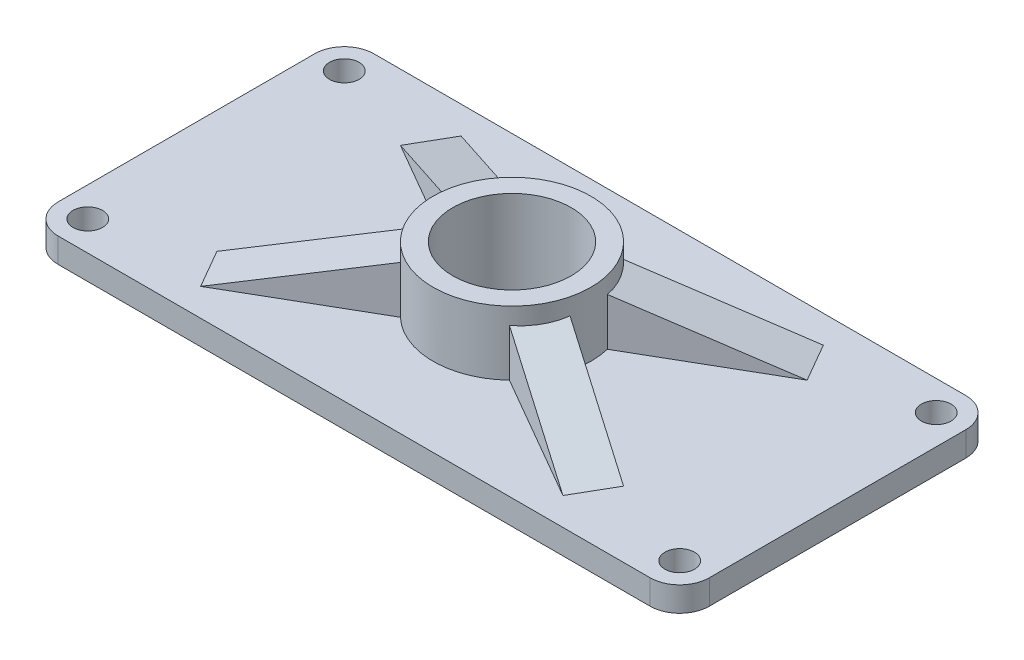
ISO-10303-21;
HEADER;
FILE_DESCRIPTION(('STEP AP214'),'2;1');
FILE_NAME('part.step','',(''),(''),'','','');
FILE_SCHEMA(('AUTOMOTIVE_DESIGN { 1 0 10303 214 1 1 1 1 }'));
ENDSEC;
DATA;
#1=APPLICATION_CONTEXT('core data for automotive mechanical design processes');
#2=APPLICATION_PROTOCOL_DEFINITION('international standard','automotive_design',2000,#1);
#3=PRODUCT_CONTEXT('',#1,'mechanical');
#4=PRODUCT('Part','Part','',(#3));
#5=PRODUCT_RELATED_PRODUCT_CATEGORY('part','',(#4));
#6=PRODUCT_DEFINITION_FORMATION('','',#4);
#7=PRODUCT_DEFINITION_CONTEXT('part definition',#1,'design');
#8=PRODUCT_DEFINITION('design','',#6,#7);
#9=PRODUCT_DEFINITION_SHAPE('','',#8);
#10=(LENGTH_UNIT() NAMED_UNIT(*) SI_UNIT(.MILLI.,.METRE.));
#11=(NAMED_UNIT(*) PLANE_ANGLE_UNIT() SI_UNIT($,.RADIAN.));
#12=(NAMED_UNIT(*) SI_UNIT($,.STERADIAN.) SOLID_ANGLE_UNIT());
#13=UNCERTAINTY_MEASURE_WITH_UNIT(LENGTH_MEASURE(1.E-05),#10,'distance_accuracy_value','');
#14=(GEOMETRIC_REPRESENTATION_CONTEXT(3) GLOBAL_UNCERTAINTY_ASSIGNED_CONTEXT((#13)) GLOBAL_UNIT_ASSIGNED_CONTEXT((#10,
#11,#12)) REPRESENTATION_CONTEXT('',''));
#15=CARTESIAN_POINT('',(0.,0.,0.));
#16=DIRECTION('',(0.,0.,1.));
#17=DIRECTION('',(1.,0.,0.));
#18=AXIS2_PLACEMENT_3D('',#15,#16,#17);
#19=CARTESIAN_POINT('',(0.,5.,0.));
#20=DIRECTION('',(0.,1.,0.));
#21=DIRECTION('',(0.,0.,1.));
#22=AXIS2_PLACEMENT_3D('',#19,#20,#21);
#23=PLANE('',#22);
#24=DIRECTION('',(0.866025403784438,0.,-0.500000000000001));
#25=VECTOR('',#24,1.);
#26=CARTESIAN_POINT('',(8.14230484541325,5.,-9.89711431702998));
#27=LINE('',#26,#25);
#28=CARTESIAN_POINT('',(11.0470861469722,5.,-11.574190583422));
#29=VERTEX_POINT('',#28);
#30=CARTESIAN_POINT('',(36.7211431702997,5.,-26.39711431703));
#31=VERTEX_POINT('',#30);
#32=EDGE_CURVE('E54',#29,#31,#27,.T.);
#33=ORIENTED_EDGE('',*,*,#32,.T.);
#34=DIRECTION('',(0.500000000000001,0.,0.866025403784438));
#35=VECTOR('',#34,1.);
#36=CARTESIAN_POINT('',(36.7211431702997,5.,-26.39711431703));
#37=LINE('',#36,#35);
#38=CARTESIAN_POINT('',(41.2211431702997,5.,-18.6028856829701));
#39=VERTEX_POINT('',#38);
#40=EDGE_CURVE('E58',#31,#39,#37,.T.);
#41=ORIENTED_EDGE('',*,*,#40,.T.);
#42=DIRECTION('',(0.866025403784438,0.,-0.500000000000001));
#43=VECTOR('',#42,1.);
#44=CARTESIAN_POINT('',(12.6423048454133,5.,-2.10288568297004));
#45=LINE('',#44,#43);
#46=CARTESIAN_POINT('',(15.5470861469722,5.,-3.77996194936209));
#47=VERTEX_POINT('',#46);
#48=EDGE_CURVE('E185',#47,#39,#45,.T.);
#49=ORIENTED_EDGE('',*,*,#48,.F.);
#50=CARTESIAN_POINT('',(0.,5.,0.));
#51=DIRECTION('',(0.,1.,0.));
#52=DIRECTION('',(0.,0.,1.));
#53=AXIS2_PLACEMENT_3D('',#50,#51,#52);
#54=CIRCLE('',#53,16.);
#55=CARTESIAN_POINT('',(15.5470861469722,5.,3.77996194936209));
#56=VERTEX_POINT('',#55);
#57=EDGE_CURVE('E174',#56,#47,#54,.T.);
#58=ORIENTED_EDGE('',*,*,#57,.F.);
#59=DIRECTION('',(0.866025403784438,0.,0.500000000000001));
#60=VECTOR('',#59,1.);
#61=CARTESIAN_POINT('',(12.6423048454133,5.,2.10288568297004));
#62=LINE('',#61,#60);
#63=CARTESIAN_POINT('',(41.2211431702997,5.,18.6028856829701));
#64=VERTEX_POINT('',#63);
#65=EDGE_CURVE('E325',#56,#64,#62,.T.);
#66=ORIENTED_EDGE('',*,*,#65,.T.);
#67=DIRECTION('',(0.500000000000001,0.,-0.866025403784438));
#68=VECTOR('',#67,1.);
#69=CARTESIAN_POINT('',(36.7211431702997,5.,26.39711431703));
#70=LINE('',#69,#68);
#71=CARTESIAN_POINT('',(36.7211431702997,5.,26.39711431703));
#72=VERTEX_POINT('',#71);
#73=EDGE_CURVE('E321',#72,#64,#70,.T.);
#74=ORIENTED_EDGE('',*,*,#73,.F.);
#75=DIRECTION('',(0.866025403784438,0.,0.500000000000001));
#76=VECTOR('',#75,1.);
#77=CARTESIAN_POINT('',(8.14230484541325,5.,9.89711431702998));
#78=LINE('',#77,#76);
#79=CARTESIAN_POINT('',(11.0470861469722,5.,11.574190583422));
#80=VERTEX_POINT('',#79);
#81=EDGE_CURVE('E324',#80,#72,#78,.T.);
#82=ORIENTED_EDGE('',*,*,#81,.F.);
#83=CARTESIAN_POINT('',(-11.0470861469722,5.,11.574190583422));
#84=VERTEX_POINT('',#83);
#85=EDGE_CURVE('E181',#84,#80,#54,.T.);
#86=ORIENTED_EDGE('',*,*,#85,.F.);
#87=DIRECTION('',(0.866025403784438,0.,-0.500000000000001));
#88=VECTOR('',#87,1.);
#89=CARTESIAN_POINT('',(-36.7211431702997,5.,26.39711431703));
#90=LINE('',#89,#88);
#91=CARTESIAN_POINT('',(-36.7211431702997,5.,26.39711431703));
#92=VERTEX_POINT('',#91);
#93=EDGE_CURVE('E345',#92,#84,#90,.T.);
#94=ORIENTED_EDGE('',*,*,#93,.F.);
#95=DIRECTION('',(0.500000000000001,0.,0.866025403784438));
#96=VECTOR('',#95,1.);
#97=CARTESIAN_POINT('',(-41.2211431702997,5.,18.6028856829701));
#98=LINE('',#97,#96);
#99=CARTESIAN_POINT('',(-41.2211431702997,5.,18.6028856829701));
#100=VERTEX_POINT('',#99);
#101=EDGE_CURVE('E338',#100,#92,#98,.T.);
#102=ORIENTED_EDGE('',*,*,#101,.F.);
#103=DIRECTION('',(0.866025403784438,0.,-0.500000000000001));
#104=VECTOR('',#103,1.);
#105=CARTESIAN_POINT('',(-41.2211431702997,5.,18.6028856829701));
#106=LINE('',#105,#104);
#107=CARTESIAN_POINT('',(-15.5470861469722,5.,3.77996194936209));
#108=VERTEX_POINT('',#107);
#109=EDGE_CURVE('E344',#100,#108,#106,.T.);
#110=ORIENTED_EDGE('',*,*,#109,.T.);
#111=CARTESIAN_POINT('',(-15.5470861469722,5.,-3.77996194936209));
#112=VERTEX_POINT('',#111);
#113=EDGE_CURVE('E184',#112,#108,#54,.T.);
#114=ORIENTED_EDGE('',*,*,#113,.F.);
#115=DIRECTION('',(0.866025403784438,0.,0.500000000000001));
#116=VECTOR('',#115,1.);
#117=CARTESIAN_POINT('',(-41.2211431702997,5.,-18.6028856829701));
#118=LINE('',#117,#116);
#119=CARTESIAN_POINT('',(-41.2211431702997,5.,-18.6028856829701));
#120=VERTEX_POINT('',#119);
#121=EDGE_CURVE('E309',#120,#112,#118,.T.);
#122=ORIENTED_EDGE('',*,*,#121,.F.);
#123=DIRECTION('',(0.500000000000001,0.,-0.866025403784438));
#124=VECTOR('',#123,1.);
#125=CARTESIAN_POINT('',(-41.2211431702997,5.,-18.6028856829701));
#126=LINE('',#125,#124);
#127=CARTESIAN_POINT('',(-36.7211431702997,5.,-26.39711431703));
#128=VERTEX_POINT('',#127);
#129=EDGE_CURVE('E306',#120,#128,#126,.T.);
#130=ORIENTED_EDGE('',*,*,#129,.T.);
#131=DIRECTION('',(0.866025403784438,0.,0.500000000000001));
#132=VECTOR('',#131,1.);
#133=CARTESIAN_POINT('',(-36.7211431702997,5.,-26.39711431703));
#134=LINE('',#133,#132);
#135=CARTESIAN_POINT('',(-11.0470861469722,5.,-11.574190583422));
#136=VERTEX_POINT('',#135);
#137=EDGE_CURVE('E310',#128,#136,#134,.T.);
#138=ORIENTED_EDGE('',*,*,#137,.T.);
#139=EDGE_CURVE('E182',#29,#136,#54,.T.);
#140=ORIENTED_EDGE('',*,*,#139,.F.);
#141=EDGE_LOOP('',(#33,#41,#49,#58,#66,#74,#82,#86,#94,#102,#110,#114,#122,#130,#138,#140));
#142=FACE_BOUND('',#141,.T.);
#143=CARTESIAN_POINT('',(60.,5.,-26.));
#144=DIRECTION('',(0.,1.,0.));
#145=DIRECTION('',(0.,0.,1.));
#146=AXIS2_PLACEMENT_3D('',#143,#144,#145);
#147=CIRCLE('',#146,3.);
#148=CARTESIAN_POINT('',(60.,5.,-23.));
#149=VERTEX_POINT('',#148);
#150=EDGE_CURVE('E229',#149,#149,#147,.T.);
#151=ORIENTED_EDGE('',*,*,#150,.F.);
#152=EDGE_LOOP('',(#151));
#153=FACE_BOUND('',#152,.T.);
#154=CARTESIAN_POINT('',(60.,5.,26.));
#155=DIRECTION('',(0.,1.,0.));
#156=DIRECTION('',(0.,0.,1.));
#157=AXIS2_PLACEMENT_3D('',#154,#155,#156);
#158=CIRCLE('',#157,3.);
#159=CARTESIAN_POINT('',(60.,5.,29.));
#160=VERTEX_POINT('',#159);
#161=EDGE_CURVE('E271',#160,#160,#158,.T.);
#162=ORIENTED_EDGE('',*,*,#161,.F.);
#163=EDGE_LOOP('',(#162));
#164=FACE_BOUND('',#163,.T.);
#165=CARTESIAN_POINT('',(-60.,5.,26.));
#166=DIRECTION('',(0.,1.,0.));
#167=DIRECTION('',(0.,0.,1.));
#168=AXIS2_PLACEMENT_3D('',#165,#166,#167);
#169=CIRCLE('',#168,3.);
#170=CARTESIAN_POINT('',(-60.,5.,29.));
#171=VERTEX_POINT('',#170);
#172=EDGE_CURVE('E274',#171,#171,#169,.T.);
#173=ORIENTED_EDGE('',*,*,#172,.F.);
#174=EDGE_LOOP('',(#173));
#175=FACE_BOUND('',#174,.T.);
#176=CARTESIAN_POINT('',(-60.,5.,-26.));
#177=DIRECTION('',(0.,1.,0.));
#178=DIRECTION('',(0.,0.,1.));
#179=AXIS2_PLACEMENT_3D('',#176,#177,#178);
#180=CIRCLE('',#179,3.);
#181=CARTESIAN_POINT('',(-60.,5.,-23.));
#182=VERTEX_POINT('',#181);
#183=EDGE_CURVE('E277',#182,#182,#180,.T.);
#184=ORIENTED_EDGE('',*,*,#183,.F.);
#185=EDGE_LOOP('',(#184));
#186=FACE_BOUND('',#185,.T.);
#187=CARTESIAN_POINT('',(-60.,5.,-26.));
#188=DIRECTION('',(0.,1.,0.));
#189=DIRECTION('',(0.,0.,1.));
#190=AXIS2_PLACEMENT_3D('',#187,#188,#189);
#191=CIRCLE('',#190,6.);
#192=CARTESIAN_POINT('',(-66.,5.,-26.));
#193=VERTEX_POINT('',#192);
#194=CARTESIAN_POINT('',(-60.,5.,-32.));
#195=VERTEX_POINT('',#194);
#196=EDGE_CURVE('E233',#193,#195,#191,.F.);
#197=ORIENTED_EDGE('',*,*,#196,.F.);
#198=DIRECTION('',(0.,0.,-1.));
#199=VECTOR('',#198,1.);
#200=CARTESIAN_POINT('',(-66.,5.,0.));
#201=LINE('',#200,#199);
#202=CARTESIAN_POINT('',(-66.,5.,26.));
#203=VERTEX_POINT('',#202);
#204=EDGE_CURVE('E295',#203,#193,#201,.T.);
#205=ORIENTED_EDGE('',*,*,#204,.F.);
#206=CARTESIAN_POINT('',(-60.,5.,26.));
#207=DIRECTION('',(0.,1.,0.));
#208=DIRECTION('',(0.,0.,1.));
#209=AXIS2_PLACEMENT_3D('',#206,#207,#208);
#210=CIRCLE('',#209,5.99999999999999);
#211=CARTESIAN_POINT('',(-60.,5.,32.));
#212=VERTEX_POINT('',#211);
#213=EDGE_CURVE('E292',#212,#203,#210,.F.);
#214=ORIENTED_EDGE('',*,*,#213,.F.);
#215=DIRECTION('',(1.,0.,0.));
#216=VECTOR('',#215,1.);
#217=CARTESIAN_POINT('',(0.,5.,32.));
#218=LINE('',#217,#216);
#219=CARTESIAN_POINT('',(60.,5.,32.));
#220=VERTEX_POINT('',#219);
#221=EDGE_CURVE('E290',#212,#220,#218,.T.);
#222=ORIENTED_EDGE('',*,*,#221,.T.);
#223=CARTESIAN_POINT('',(60.,5.,26.));
#224=DIRECTION('',(0.,1.,0.));
#225=DIRECTION('',(0.,0.,1.));
#226=AXIS2_PLACEMENT_3D('',#223,#224,#225);
#227=CIRCLE('',#226,5.99999999999999);
#228=CARTESIAN_POINT('',(66.,5.,26.));
#229=VERTEX_POINT('',#228);
#230=EDGE_CURVE('E288',#220,#229,#227,.T.);
#231=ORIENTED_EDGE('',*,*,#230,.T.);
#232=DIRECTION('',(0.,0.,-1.));
#233=VECTOR('',#232,1.);
#234=CARTESIAN_POINT('',(66.,5.,0.));
#235=LINE('',#234,#233);
#236=CARTESIAN_POINT('',(66.,5.,-26.));
#237=VERTEX_POINT('',#236);
#238=EDGE_CURVE('E286',#229,#237,#235,.T.);
#239=ORIENTED_EDGE('',*,*,#238,.T.);
#240=CARTESIAN_POINT('',(60.,5.,-26.));
#241=DIRECTION('',(0.,1.,0.));
#242=DIRECTION('',(0.,0.,1.));
#243=AXIS2_PLACEMENT_3D('',#240,#241,#242);
#244=CIRCLE('',#243,6.);
#245=CARTESIAN_POINT('',(60.,5.,-32.));
#246=VERTEX_POINT('',#245);
#247=EDGE_CURVE('E283',#246,#237,#244,.F.);
#248=ORIENTED_EDGE('',*,*,#247,.F.);
#249=DIRECTION('',(1.,0.,0.));
#250=VECTOR('',#249,1.);
#251=CARTESIAN_POINT('',(0.,5.,-32.));
#252=LINE('',#251,#250);
#253=EDGE_CURVE('E280',#195,#246,#252,.T.);
#254=ORIENTED_EDGE('',*,*,#253,.F.);
#255=EDGE_LOOP('',(#197,#205,#214,#222,#231,#239,#248,#254));
#256=FACE_BOUND('',#255,.T.);
#257=ADVANCED_FACE('F39',(#142,#153,#164,#175,#186,#256),#23,.T.);
#258=CARTESIAN_POINT('',(0.,18.,0.));
#259=DIRECTION('',(0.,-1.,0.));
#260=DIRECTION('',(0.,0.,-1.));
#261=AXIS2_PLACEMENT_3D('',#258,#259,#260);
#262=CYLINDRICAL_SURFACE('',#261,16.);
#263=CARTESIAN_POINT('',(0.,18.,0.));
#264=DIRECTION('',(0.,1.,0.));
#265=DIRECTION('',(0.,0.,1.));
#266=AXIS2_PLACEMENT_3D('',#263,#264,#265);
#267=CIRCLE('',#266,16.);
#268=CARTESIAN_POINT('',(0.,18.,16.));
#269=VERTEX_POINT('',#268);
#270=EDGE_CURVE('E268',#269,#269,#267,.T.);
#271=ORIENTED_EDGE('',*,*,#270,.F.);
#272=EDGE_LOOP('',(#271));
#273=FACE_BOUND('',#272,.T.);
#274=CARTESIAN_POINT('',(0.,19.6213863304805,0.));
#275=DIRECTION('',(0.267616567329812,0.951056516295155,-0.154508497187471));
#276=DIRECTION('',(0.823639103546333,-0.309016994374941,-0.475528258147579));
#277=AXIS2_PLACEMENT_3D('',#274,#275,#276);
#278=ELLIPSE('',#277,16.8233955878122,16.);
#279=CARTESIAN_POINT('',(15.5470861469722,14.6325197536147,-3.77996194936209));
#280=VERTEX_POINT('',#279);
#281=CARTESIAN_POINT('',(11.0470861469722,14.6325197536147,-11.574190583422));
#282=VERTEX_POINT('',#281);
#283=EDGE_CURVE('E347',#280,#282,#278,.T.);
#284=ORIENTED_EDGE('',*,*,#283,.T.);
#285=DIRECTION('',(0.,-1.,0.));
#286=VECTOR('',#285,1.);
#287=CARTESIAN_POINT('',(11.0470861469722,18.,-11.574190583422));
#288=LINE('',#287,#286);
#289=EDGE_CURVE('E11',#282,#29,#288,.T.);
#290=ORIENTED_EDGE('',*,*,#289,.T.);
#291=ORIENTED_EDGE('',*,*,#139,.T.);
#292=DIRECTION('',(0.,-1.,0.));
#293=VECTOR('',#292,1.);
#294=CARTESIAN_POINT('',(-11.0470861469722,18.,-11.574190583422));
#295=LINE('',#294,#293);
#296=CARTESIAN_POINT('',(-11.0470861469722,14.6325197536147,-11.574190583422));
#297=VERTEX_POINT('',#296);
#298=EDGE_CURVE('E208',#136,#297,#295,.F.);
#299=ORIENTED_EDGE('',*,*,#298,.T.);
#300=CARTESIAN_POINT('',(0.,19.6213863304805,0.));
#301=DIRECTION('',(0.267616567329812,-0.951056516295155,0.154508497187471));
#302=DIRECTION('',(-0.823639103546333,-0.309016994374942,-0.475528258147579));
#303=AXIS2_PLACEMENT_3D('',#300,#301,#302);
#304=ELLIPSE('',#303,16.8233955878122,16.);
#305=CARTESIAN_POINT('',(-15.5470861469722,14.6325197536147,-3.77996194936209));
#306=VERTEX_POINT('',#305);
#307=EDGE_CURVE('E205',#306,#297,#304,.T.);
#308=ORIENTED_EDGE('',*,*,#307,.F.);
#309=DIRECTION('',(0.,-1.,0.));
#310=VECTOR('',#309,1.);
#311=CARTESIAN_POINT('',(-15.5470861469722,18.,-3.77996194936209));
#312=LINE('',#311,#310);
#313=EDGE_CURVE('E203',#112,#306,#312,.F.);
#314=ORIENTED_EDGE('',*,*,#313,.F.);
#315=ORIENTED_EDGE('',*,*,#113,.T.);
#316=DIRECTION('',(0.,-1.,0.));
#317=VECTOR('',#316,1.);
#318=CARTESIAN_POINT('',(-15.5470861469722,18.,3.77996194936209));
#319=LINE('',#318,#317);
#320=CARTESIAN_POINT('',(-15.5470861469722,14.6325197536147,3.77996194936209));
#321=VERTEX_POINT('',#320);
#322=EDGE_CURVE('E194',#321,#108,#319,.T.);
#323=ORIENTED_EDGE('',*,*,#322,.F.);
#324=CARTESIAN_POINT('',(0.,19.6213863304805,0.));
#325=DIRECTION('',(-0.267616567329812,0.951056516295155,0.154508497187471));
#326=DIRECTION('',(-0.823639103546333,-0.309016994374942,0.475528258147579));
#327=AXIS2_PLACEMENT_3D('',#324,#325,#326);
#328=ELLIPSE('',#327,16.8233955878122,16.);
#329=CARTESIAN_POINT('',(-11.0470861469722,14.6325197536147,11.574190583422));
#330=VERTEX_POINT('',#329);
#331=EDGE_CURVE('E331',#321,#330,#328,.T.);
#332=ORIENTED_EDGE('',*,*,#331,.T.);
#333=DIRECTION('',(0.,-1.,0.));
#334=VECTOR('',#333,1.);
#335=CARTESIAN_POINT('',(-11.0470861469722,18.,11.574190583422));
#336=LINE('',#335,#334);
#337=EDGE_CURVE('E195',#330,#84,#336,.T.);
#338=ORIENTED_EDGE('',*,*,#337,.T.);
#339=ORIENTED_EDGE('',*,*,#85,.T.);
#340=DIRECTION('',(0.,-1.,0.));
#341=VECTOR('',#340,1.);
#342=CARTESIAN_POINT('',(11.0470861469722,18.,11.574190583422));
#343=LINE('',#342,#341);
#344=CARTESIAN_POINT('',(11.0470861469722,14.6325197536147,11.574190583422));
#345=VERTEX_POINT('',#344);
#346=EDGE_CURVE('E200',#80,#345,#343,.F.);
#347=ORIENTED_EDGE('',*,*,#346,.T.);
#348=CARTESIAN_POINT('',(0.,19.6213863304805,0.));
#349=DIRECTION('',(-0.267616567329812,-0.951056516295155,-0.154508497187471));
#350=DIRECTION('',(0.823639103546333,-0.309016994374941,0.475528258147579));
#351=AXIS2_PLACEMENT_3D('',#348,#349,#350);
#352=ELLIPSE('',#351,16.8233955878122,16.);
#353=CARTESIAN_POINT('',(15.5470861469722,14.6325197536147,3.77996194936209));
#354=VERTEX_POINT('',#353);
#355=EDGE_CURVE('E316',#354,#345,#352,.T.);
#356=ORIENTED_EDGE('',*,*,#355,.F.);
#357=DIRECTION('',(0.,-1.,0.));
#358=VECTOR('',#357,1.);
#359=CARTESIAN_POINT('',(15.5470861469722,18.,3.77996194936209));
#360=LINE('',#359,#358);
#361=EDGE_CURVE('E179',#56,#354,#360,.F.);
#362=ORIENTED_EDGE('',*,*,#361,.F.);
#363=ORIENTED_EDGE('',*,*,#57,.T.);
#364=DIRECTION('',(0.,-1.,0.));
#365=VECTOR('',#364,1.);
#366=CARTESIAN_POINT('',(15.5470861469722,18.,-3.77996194936209));
#367=LINE('',#366,#365);
#368=EDGE_CURVE('E47',#280,#47,#367,.T.);
#369=ORIENTED_EDGE('',*,*,#368,.F.);
#370=EDGE_LOOP('',(#284,#290,#291,#299,#308,#314,#315,#323,#332,#338,#339,#347,#356,#362,#363,#369));
#371=FACE_BOUND('',#370,.T.);
#372=ADVANCED_FACE('F175',(#273,#371),#262,.T.);
#373=CARTESIAN_POINT('',(-60.,5.,-26.));
#374=DIRECTION('',(0.,-1.,0.));
#375=DIRECTION('',(0.,0.,-1.));
#376=AXIS2_PLACEMENT_3D('',#373,#374,#375);
#377=CYLINDRICAL_SURFACE('',#376,6.);
#378=CARTESIAN_POINT('',(-60.,0.,-26.));
#379=DIRECTION('',(0.,1.,0.));
#380=DIRECTION('',(0.,0.,1.));
#381=AXIS2_PLACEMENT_3D('',#378,#379,#380);
#382=CIRCLE('',#381,6.);
#383=CARTESIAN_POINT('',(-66.,0.,-26.));
#384=VERTEX_POINT('',#383);
#385=CARTESIAN_POINT('',(-60.,0.,-32.));
#386=VERTEX_POINT('',#385);
#387=EDGE_CURVE('E265',#384,#386,#382,.F.);
#388=ORIENTED_EDGE('',*,*,#387,.F.);
#389=DIRECTION('',(0.,-1.,0.));
#390=VECTOR('',#389,1.);
#391=CARTESIAN_POINT('',(-66.,5.,-26.));
#392=LINE('',#391,#390);
#393=EDGE_CURVE('E211',#193,#384,#392,.T.);
#394=ORIENTED_EDGE('',*,*,#393,.F.);
#395=ORIENTED_EDGE('',*,*,#196,.T.);
#396=DIRECTION('',(0.,-1.,0.));
#397=VECTOR('',#396,1.);
#398=CARTESIAN_POINT('',(-60.,5.,-32.));
#399=LINE('',#398,#397);
#400=EDGE_CURVE('E227',#195,#386,#399,.T.);
#401=ORIENTED_EDGE('',*,*,#400,.T.);
#402=EDGE_LOOP('',(#388,#394,#395,#401));
#403=FACE_BOUND('',#402,.T.);
#404=ADVANCED_FACE('F41',(#403),#377,.T.);
#405=CARTESIAN_POINT('',(-66.,5.,0.));
#406=DIRECTION('',(-1.,0.,0.));
#407=DIRECTION('',(0.,0.,1.));
#408=AXIS2_PLACEMENT_3D('',#405,#406,#407);
#409=PLANE('',#408);
#410=DIRECTION('',(0.,0.,-1.));
#411=VECTOR('',#410,1.);
#412=CARTESIAN_POINT('',(-66.,0.,0.));
#413=LINE('',#412,#411);
#414=CARTESIAN_POINT('',(-66.,0.,26.));
#415=VERTEX_POINT('',#414);
#416=EDGE_CURVE('E262',#415,#384,#413,.T.);
#417=ORIENTED_EDGE('',*,*,#416,.F.);
#418=DIRECTION('',(0.,-1.,0.));
#419=VECTOR('',#418,1.);
#420=CARTESIAN_POINT('',(-66.,5.,26.));
#421=LINE('',#420,#419);
#422=EDGE_CURVE('E213',#203,#415,#421,.T.);
#423=ORIENTED_EDGE('',*,*,#422,.F.);
#424=ORIENTED_EDGE('',*,*,#204,.T.);
#425=ORIENTED_EDGE('',*,*,#393,.T.);
#426=EDGE_LOOP('',(#417,#423,#424,#425));
#427=FACE_BOUND('',#426,.T.);
#428=ADVANCED_FACE('F442',(#427),#409,.T.);
#429=CARTESIAN_POINT('',(-60.,5.,26.));
#430=DIRECTION('',(0.,-1.,0.));
#431=DIRECTION('',(0.,0.,-1.));
#432=AXIS2_PLACEMENT_3D('',#429,#430,#431);
#433=CYLINDRICAL_SURFACE('',#432,5.99999999999999);
#434=CARTESIAN_POINT('',(-60.,0.,26.));
#435=DIRECTION('',(0.,1.,0.));
#436=DIRECTION('',(0.,0.,1.));
#437=AXIS2_PLACEMENT_3D('',#434,#435,#436);
#438=CIRCLE('',#437,5.99999999999999);
#439=CARTESIAN_POINT('',(-60.,0.,32.));
#440=VERTEX_POINT('',#439);
#441=EDGE_CURVE('E259',#440,#415,#438,.F.);
#442=ORIENTED_EDGE('',*,*,#441,.F.);
#443=DIRECTION('',(0.,-1.,0.));
#444=VECTOR('',#443,1.);
#445=CARTESIAN_POINT('',(-60.,5.,32.));
#446=LINE('',#445,#444);
#447=EDGE_CURVE('E215',#212,#440,#446,.T.);
#448=ORIENTED_EDGE('',*,*,#447,.F.);
#449=ORIENTED_EDGE('',*,*,#213,.T.);
#450=ORIENTED_EDGE('',*,*,#422,.T.);
#451=EDGE_LOOP('',(#442,#448,#449,#450));
#452=FACE_BOUND('',#451,.T.);
#453=ADVANCED_FACE('F439',(#452),#433,.T.);
#454=CARTESIAN_POINT('',(0.,5.,32.));
#455=DIRECTION('',(0.,0.,-1.));
#456=DIRECTION('',(-1.,0.,0.));
#457=AXIS2_PLACEMENT_3D('',#454,#455,#456);
#458=PLANE('',#457);
#459=DIRECTION('',(1.,0.,0.));
#460=VECTOR('',#459,1.);
#461=CARTESIAN_POINT('',(0.,0.,32.));
#462=LINE('',#461,#460);
#463=CARTESIAN_POINT('',(60.,0.,32.));
#464=VERTEX_POINT('',#463);
#465=EDGE_CURVE('E257',#440,#464,#462,.T.);
#466=ORIENTED_EDGE('',*,*,#465,.T.);
#467=DIRECTION('',(0.,-1.,0.));
#468=VECTOR('',#467,1.);
#469=CARTESIAN_POINT('',(60.,5.,32.));
#470=LINE('',#469,#468);
#471=EDGE_CURVE('E217',#220,#464,#470,.T.);
#472=ORIENTED_EDGE('',*,*,#471,.F.);
#473=ORIENTED_EDGE('',*,*,#221,.F.);
#474=ORIENTED_EDGE('',*,*,#447,.T.);
#475=EDGE_LOOP('',(#466,#472,#473,#474));
#476=FACE_BOUND('',#475,.T.);
#477=ADVANCED_FACE('F435',(#476),#458,.F.);
#478=CARTESIAN_POINT('',(60.,5.,26.));
#479=DIRECTION('',(0.,-1.,0.));
#480=DIRECTION('',(0.,0.,-1.));
#481=AXIS2_PLACEMENT_3D('',#478,#479,#480);
#482=CYLINDRICAL_SURFACE('',#481,5.99999999999999);
#483=CARTESIAN_POINT('',(60.,0.,26.));
#484=DIRECTION('',(0.,1.,0.));
#485=DIRECTION('',(0.,0.,1.));
#486=AXIS2_PLACEMENT_3D('',#483,#484,#485);
#487=CIRCLE('',#486,5.99999999999999);
#488=CARTESIAN_POINT('',(66.,0.,26.));
#489=VERTEX_POINT('',#488);
#490=EDGE_CURVE('E255',#464,#489,#487,.T.);
#491=ORIENTED_EDGE('',*,*,#490,.T.);
#492=DIRECTION('',(0.,-1.,0.));
#493=VECTOR('',#492,1.);
#494=CARTESIAN_POINT('',(66.,5.,26.));
#495=LINE('',#494,#493);
#496=EDGE_CURVE('E220',#229,#489,#495,.T.);
#497=ORIENTED_EDGE('',*,*,#496,.F.);
#498=ORIENTED_EDGE('',*,*,#230,.F.);
#499=ORIENTED_EDGE('',*,*,#471,.T.);
#500=EDGE_LOOP('',(#491,#497,#498,#499));
#501=FACE_BOUND('',#500,.T.);
#502=ADVANCED_FACE('F431',(#501),#482,.T.);
#503=CARTESIAN_POINT('',(66.,5.,0.));
#504=DIRECTION('',(-1.,0.,0.));
#505=DIRECTION('',(0.,0.,1.));
#506=AXIS2_PLACEMENT_3D('',#503,#504,#505);
#507=PLANE('',#506);
#508=DIRECTION('',(0.,0.,-1.));
#509=VECTOR('',#508,1.);
#510=CARTESIAN_POINT('',(66.,0.,0.));
#511=LINE('',#510,#509);
#512=CARTESIAN_POINT('',(66.,0.,-26.));
#513=VERTEX_POINT('',#512);
#514=EDGE_CURVE('E252',#489,#513,#511,.T.);
#515=ORIENTED_EDGE('',*,*,#514,.T.);
#516=DIRECTION('',(0.,-1.,0.));
#517=VECTOR('',#516,1.);
#518=CARTESIAN_POINT('',(66.,5.,-26.));
#519=LINE('',#518,#517);
#520=EDGE_CURVE('E223',#237,#513,#519,.T.);
#521=ORIENTED_EDGE('',*,*,#520,.F.);
#522=ORIENTED_EDGE('',*,*,#238,.F.);
#523=ORIENTED_EDGE('',*,*,#496,.T.);
#524=EDGE_LOOP('',(#515,#521,#522,#523));
#525=FACE_BOUND('',#524,.T.);
#526=ADVANCED_FACE('F427',(#525),#507,.F.);
#527=CARTESIAN_POINT('',(60.,5.,-26.));
#528=DIRECTION('',(0.,-1.,0.));
#529=DIRECTION('',(0.,0.,-1.));
#530=AXIS2_PLACEMENT_3D('',#527,#528,#529);
#531=CYLINDRICAL_SURFACE('',#530,6.);
#532=CARTESIAN_POINT('',(60.,0.,-26.));
#533=DIRECTION('',(0.,1.,0.));
#534=DIRECTION('',(0.,0.,1.));
#535=AXIS2_PLACEMENT_3D('',#532,#533,#534);
#536=CIRCLE('',#535,6.);
#537=CARTESIAN_POINT('',(60.,0.,-32.));
#538=VERTEX_POINT('',#537);
#539=EDGE_CURVE('E249',#538,#513,#536,.F.);
#540=ORIENTED_EDGE('',*,*,#539,.F.);
#541=DIRECTION('',(0.,-1.,0.));
#542=VECTOR('',#541,1.);
#543=CARTESIAN_POINT('',(60.,5.,-32.));
#544=LINE('',#543,#542);
#545=EDGE_CURVE('E225',#246,#538,#544,.T.);
#546=ORIENTED_EDGE('',*,*,#545,.F.);
#547=ORIENTED_EDGE('',*,*,#247,.T.);
#548=ORIENTED_EDGE('',*,*,#520,.T.);
#549=EDGE_LOOP('',(#540,#546,#547,#548));
#550=FACE_BOUND('',#549,.T.);
#551=ADVANCED_FACE('F409',(#550),#531,.T.);
#552=CARTESIAN_POINT('',(60.,5.,-26.));
#553=DIRECTION('',(0.,-1.,0.));
#554=DIRECTION('',(0.,0.,-1.));
#555=AXIS2_PLACEMENT_3D('',#552,#553,#554);
#556=CYLINDRICAL_SURFACE('',#555,3.);
#557=ORIENTED_EDGE('',*,*,#150,.T.);
#558=EDGE_LOOP('',(#557));
#559=FACE_BOUND('',#558,.T.);
#560=CARTESIAN_POINT('',(60.,0.,-26.));
#561=DIRECTION('',(0.,1.,0.));
#562=DIRECTION('',(0.,0.,1.));
#563=AXIS2_PLACEMENT_3D('',#560,#561,#562);
#564=CIRCLE('',#563,3.);
#565=CARTESIAN_POINT('',(60.,0.,-23.));
#566=VERTEX_POINT('',#565);
#567=EDGE_CURVE('E234',#566,#566,#564,.T.);
#568=ORIENTED_EDGE('',*,*,#567,.F.);
#569=EDGE_LOOP('',(#568));
#570=FACE_BOUND('',#569,.T.);
#571=ADVANCED_FACE('F405',(#559,#570),#556,.F.);
#572=CARTESIAN_POINT('',(60.,5.,26.));
#573=DIRECTION('',(0.,-1.,0.));
#574=DIRECTION('',(0.,0.,-1.));
#575=AXIS2_PLACEMENT_3D('',#572,#573,#574);
#576=CYLINDRICAL_SURFACE('',#575,3.);
#577=ORIENTED_EDGE('',*,*,#161,.T.);
#578=EDGE_LOOP('',(#577));
#579=FACE_BOUND('',#578,.T.);
#580=CARTESIAN_POINT('',(60.,0.,26.));
#581=DIRECTION('',(0.,1.,0.));
#582=DIRECTION('',(0.,0.,1.));
#583=AXIS2_PLACEMENT_3D('',#580,#581,#582);
#584=CIRCLE('',#583,3.);
#585=CARTESIAN_POINT('',(60.,0.,29.));
#586=VERTEX_POINT('',#585);
#587=EDGE_CURVE('E237',#586,#586,#584,.T.);
#588=ORIENTED_EDGE('',*,*,#587,.F.);
#589=EDGE_LOOP('',(#588));
#590=FACE_BOUND('',#589,.T.);
#591=ADVANCED_FACE('F408',(#579,#590),#576,.F.);
#592=CARTESIAN_POINT('',(-60.,5.,26.));
#593=DIRECTION('',(0.,-1.,0.));
#594=DIRECTION('',(0.,0.,-1.));
#595=AXIS2_PLACEMENT_3D('',#592,#593,#594);
#596=CYLINDRICAL_SURFACE('',#595,3.);
#597=ORIENTED_EDGE('',*,*,#172,.T.);
#598=EDGE_LOOP('',(#597));
#599=FACE_BOUND('',#598,.T.);
#600=CARTESIAN_POINT('',(-60.,0.,26.));
#601=DIRECTION('',(0.,1.,0.));
#602=DIRECTION('',(0.,0.,1.));
#603=AXIS2_PLACEMENT_3D('',#600,#601,#602);
#604=CIRCLE('',#603,3.);
#605=CARTESIAN_POINT('',(-60.,0.,29.));
#606=VERTEX_POINT('',#605);
#607=EDGE_CURVE('E240',#606,#606,#604,.T.);
#608=ORIENTED_EDGE('',*,*,#607,.F.);
#609=EDGE_LOOP('',(#608));
#610=FACE_BOUND('',#609,.T.);
#611=ADVANCED_FACE('F413',(#599,#610),#596,.F.);
#612=CARTESIAN_POINT('',(-60.,5.,-26.));
#613=DIRECTION('',(0.,-1.,0.));
#614=DIRECTION('',(0.,0.,-1.));
#615=AXIS2_PLACEMENT_3D('',#612,#613,#614);
#616=CYLINDRICAL_SURFACE('',#615,3.);
#617=ORIENTED_EDGE('',*,*,#183,.T.);
#618=EDGE_LOOP('',(#617));
#619=FACE_BOUND('',#618,.T.);
#620=CARTESIAN_POINT('',(-60.,0.,-26.));
#621=DIRECTION('',(0.,1.,0.));
#622=DIRECTION('',(0.,0.,1.));
#623=AXIS2_PLACEMENT_3D('',#620,#621,#622);
#624=CIRCLE('',#623,3.);
#625=CARTESIAN_POINT('',(-60.,0.,-23.));
#626=VERTEX_POINT('',#625);
#627=EDGE_CURVE('E243',#626,#626,#624,.T.);
#628=ORIENTED_EDGE('',*,*,#627,.F.);
#629=EDGE_LOOP('',(#628));
#630=FACE_BOUND('',#629,.T.);
#631=ADVANCED_FACE('F417',(#619,#630),#616,.F.);
#632=CARTESIAN_POINT('',(0.,5.,-32.));
#633=DIRECTION('',(0.,0.,-1.));
#634=DIRECTION('',(-1.,0.,0.));
#635=AXIS2_PLACEMENT_3D('',#632,#633,#634);
#636=PLANE('',#635);
#637=DIRECTION('',(1.,0.,0.));
#638=VECTOR('',#637,1.);
#639=CARTESIAN_POINT('',(0.,0.,-32.));
#640=LINE('',#639,#638);
#641=EDGE_CURVE('E246',#386,#538,#640,.T.);
#642=ORIENTED_EDGE('',*,*,#641,.F.);
#643=ORIENTED_EDGE('',*,*,#400,.F.);
#644=ORIENTED_EDGE('',*,*,#253,.T.);
#645=ORIENTED_EDGE('',*,*,#545,.T.);
#646=EDGE_LOOP('',(#642,#643,#644,#645));
#647=FACE_BOUND('',#646,.T.);
#648=ADVANCED_FACE('F403',(#647),#636,.T.);
#649=CARTESIAN_POINT('',(0.,5.,0.));
#650=DIRECTION('',(0.,-1.,0.));
#651=DIRECTION('',(0.,0.,-1.));
#652=AXIS2_PLACEMENT_3D('',#649,#650,#651);
#653=CYLINDRICAL_SURFACE('',#652,12.);
#654=CARTESIAN_POINT('',(0.,0.,0.));
#655=DIRECTION('',(0.,1.,0.));
#656=DIRECTION('',(0.,0.,1.));
#657=AXIS2_PLACEMENT_3D('',#654,#655,#656);
#658=CIRCLE('',#657,12.);
#659=CARTESIAN_POINT('',(0.,0.,12.));
#660=VERTEX_POINT('',#659);
#661=EDGE_CURVE('E230',#660,#660,#658,.T.);
#662=ORIENTED_EDGE('',*,*,#661,.F.);
#663=EDGE_LOOP('',(#662));
#664=FACE_BOUND('',#663,.T.);
#665=CARTESIAN_POINT('',(0.,18.,0.));
#666=DIRECTION('',(0.,1.,0.));
#667=DIRECTION('',(0.,0.,1.));
#668=AXIS2_PLACEMENT_3D('',#665,#666,#667);
#669=CIRCLE('',#668,12.);
#670=CARTESIAN_POINT('',(0.,18.,12.));
#671=VERTEX_POINT('',#670);
#672=EDGE_CURVE('E303',#671,#671,#669,.T.);
#673=ORIENTED_EDGE('',*,*,#672,.T.);
#674=EDGE_LOOP('',(#673));
#675=FACE_BOUND('',#674,.T.);
#676=ADVANCED_FACE('F399',(#664,#675),#653,.F.);
#677=CARTESIAN_POINT('',(0.,0.,0.));
#678=DIRECTION('',(0.,1.,0.));
#679=DIRECTION('',(0.,0.,1.));
#680=AXIS2_PLACEMENT_3D('',#677,#678,#679);
#681=PLANE('',#680);
#682=ORIENTED_EDGE('',*,*,#387,.T.);
#683=ORIENTED_EDGE('',*,*,#641,.T.);
#684=ORIENTED_EDGE('',*,*,#539,.T.);
#685=ORIENTED_EDGE('',*,*,#514,.F.);
#686=ORIENTED_EDGE('',*,*,#490,.F.);
#687=ORIENTED_EDGE('',*,*,#465,.F.);
#688=ORIENTED_EDGE('',*,*,#441,.T.);
#689=ORIENTED_EDGE('',*,*,#416,.T.);
#690=EDGE_LOOP('',(#682,#683,#684,#685,#686,#687,#688,#689));
#691=FACE_BOUND('',#690,.T.);
#692=ORIENTED_EDGE('',*,*,#627,.T.);
#693=EDGE_LOOP('',(#692));
#694=FACE_BOUND('',#693,.T.);
#695=ORIENTED_EDGE('',*,*,#607,.T.);
#696=EDGE_LOOP('',(#695));
#697=FACE_BOUND('',#696,.T.);
#698=ORIENTED_EDGE('',*,*,#587,.T.);
#699=EDGE_LOOP('',(#698));
#700=FACE_BOUND('',#699,.T.);
#701=ORIENTED_EDGE('',*,*,#567,.T.);
#702=EDGE_LOOP('',(#701));
#703=FACE_BOUND('',#702,.T.);
#704=ORIENTED_EDGE('',*,*,#661,.T.);
#705=EDGE_LOOP('',(#704));
#706=FACE_BOUND('',#705,.T.);
#707=ADVANCED_FACE('F395',(#691,#694,#697,#700,#703,#706),#681,.F.);
#708=CARTESIAN_POINT('',(0.,18.,0.));
#709=DIRECTION('',(0.,1.,0.));
#710=DIRECTION('',(0.,0.,1.));
#711=AXIS2_PLACEMENT_3D('',#708,#709,#710);
#712=PLANE('',#711);
#713=ORIENTED_EDGE('',*,*,#270,.T.);
#714=EDGE_LOOP('',(#713));
#715=FACE_BOUND('',#714,.T.);
#716=ORIENTED_EDGE('',*,*,#672,.F.);
#717=EDGE_LOOP('',(#716));
#718=FACE_BOUND('',#717,.T.);
#719=ADVANCED_FACE('F398',(#715,#718),#712,.T.);
#720=CARTESIAN_POINT('',(-2.25,0.,3.89711431702997));
#721=DIRECTION('',(0.500000000000001,0.,-0.866025403784438));
#722=DIRECTION('',(-0.866025403784438,0.,-0.500000000000001));
#723=AXIS2_PLACEMENT_3D('',#720,#721,#722);
#724=PLANE('',#723);
#725=ORIENTED_EDGE('',*,*,#121,.T.);
#726=ORIENTED_EDGE('',*,*,#313,.T.);
#727=DIRECTION('',(-0.823639103546333,-0.309016994374942,-0.475528258147579));
#728=VECTOR('',#727,1.);
#729=CARTESIAN_POINT('',(-12.6423048454133,15.7223499756857,-2.10288568297004));
#730=LINE('',#729,#728);
#731=EDGE_CURVE('E313',#306,#120,#730,.T.);
#732=ORIENTED_EDGE('',*,*,#731,.T.);
#733=EDGE_LOOP('',(#725,#726,#732));
#734=FACE_BOUND('',#733,.T.);
#735=ADVANCED_FACE('F484',(#734),#724,.F.);
#736=CARTESIAN_POINT('',(2.25000000000001,0.,-3.89711431702997));
#737=DIRECTION('',(0.500000000000001,0.,-0.866025403784438));
#738=DIRECTION('',(-0.866025403784438,0.,-0.500000000000001));
#739=AXIS2_PLACEMENT_3D('',#736,#737,#738);
#740=PLANE('',#739);
#741=ORIENTED_EDGE('',*,*,#298,.F.);
#742=ORIENTED_EDGE('',*,*,#137,.F.);
#743=DIRECTION('',(-0.823639103546333,-0.309016994374942,-0.475528258147579));
#744=VECTOR('',#743,1.);
#745=CARTESIAN_POINT('',(-8.14230484541325,15.7223499756857,-9.89711431702998));
#746=LINE('',#745,#744);
#747=EDGE_CURVE('E314',#297,#128,#746,.T.);
#748=ORIENTED_EDGE('',*,*,#747,.F.);
#749=EDGE_LOOP('',(#741,#742,#748));
#750=FACE_BOUND('',#749,.T.);
#751=ADVANCED_FACE('F489',(#750),#740,.T.);
#752=CARTESIAN_POINT('',(-12.6423048454133,15.7223499756857,-2.10288568297004));
#753=DIRECTION('',(0.267616567329812,-0.951056516295155,0.154508497187471));
#754=DIRECTION('',(0.962616130967098,0.270869312403482,0.));
#755=AXIS2_PLACEMENT_3D('',#752,#753,#754);
#756=PLANE('',#755);
#757=ORIENTED_EDGE('',*,*,#731,.F.);
#758=ORIENTED_EDGE('',*,*,#307,.T.);
#759=ORIENTED_EDGE('',*,*,#747,.T.);
#760=ORIENTED_EDGE('',*,*,#129,.F.);
#761=EDGE_LOOP('',(#757,#758,#759,#760));
#762=FACE_BOUND('',#761,.T.);
#763=ADVANCED_FACE('F384',(#762),#756,.F.);
#764=CARTESIAN_POINT('',(-2.25,0.,3.89711431702997));
#765=DIRECTION('',(-0.500000000000001,0.,0.866025403784438));
#766=DIRECTION('',(0.866025403784438,0.,0.500000000000001));
#767=AXIS2_PLACEMENT_3D('',#764,#765,#766);
#768=PLANE('',#767);
#769=ORIENTED_EDGE('',*,*,#346,.F.);
#770=ORIENTED_EDGE('',*,*,#81,.T.);
#771=DIRECTION('',(-0.823639103546333,0.309016994374941,-0.475528258147579));
#772=VECTOR('',#771,1.);
#773=CARTESIAN_POINT('',(36.7211431702997,5.,26.39711431703));
#774=LINE('',#773,#772);
#775=EDGE_CURVE('E327',#72,#345,#774,.T.);
#776=ORIENTED_EDGE('',*,*,#775,.T.);
#777=EDGE_LOOP('',(#769,#770,#776));
#778=FACE_BOUND('',#777,.T.);
#779=ADVANCED_FACE('F370',(#778),#768,.T.);
#780=CARTESIAN_POINT('',(2.25,0.,-3.89711431702997));
#781=DIRECTION('',(-0.500000000000001,0.,0.866025403784438));
#782=DIRECTION('',(0.866025403784438,0.,0.500000000000001));
#783=AXIS2_PLACEMENT_3D('',#780,#781,#782);
#784=PLANE('',#783);
#785=ORIENTED_EDGE('',*,*,#65,.F.);
#786=ORIENTED_EDGE('',*,*,#361,.T.);
#787=DIRECTION('',(-0.823639103546333,0.309016994374941,-0.475528258147579));
#788=VECTOR('',#787,1.);
#789=CARTESIAN_POINT('',(41.2211431702997,5.,18.6028856829701));
#790=LINE('',#789,#788);
#791=EDGE_CURVE('E328',#64,#354,#790,.T.);
#792=ORIENTED_EDGE('',*,*,#791,.F.);
#793=EDGE_LOOP('',(#785,#786,#792));
#794=FACE_BOUND('',#793,.T.);
#795=ADVANCED_FACE('F375',(#794),#784,.F.);
#796=CARTESIAN_POINT('',(36.7211431702997,5.,26.39711431703));
#797=DIRECTION('',(-0.267616567329812,-0.951056516295155,-0.154508497187471));
#798=DIRECTION('',(0.962616130967098,-0.270869312403482,0.));
#799=AXIS2_PLACEMENT_3D('',#796,#797,#798);
#800=PLANE('',#799);
#801=ORIENTED_EDGE('',*,*,#791,.T.);
#802=ORIENTED_EDGE('',*,*,#355,.T.);
#803=ORIENTED_EDGE('',*,*,#775,.F.);
#804=ORIENTED_EDGE('',*,*,#73,.T.);
#805=EDGE_LOOP('',(#801,#802,#803,#804));
#806=FACE_BOUND('',#805,.T.);
#807=ADVANCED_FACE('F372',(#806),#800,.F.);
#808=CARTESIAN_POINT('',(-2.25,0.,-3.89711431702997));
#809=DIRECTION('',(0.500000000000001,0.,0.866025403784438));
#810=DIRECTION('',(-0.866025403784438,0.,0.500000000000001));
#811=AXIS2_PLACEMENT_3D('',#808,#809,#810);
#812=PLANE('',#811);
#813=DIRECTION('',(-0.823639103546333,-0.309016994374942,0.475528258147579));
#814=VECTOR('',#813,1.);
#815=CARTESIAN_POINT('',(-12.6423048454133,15.7223499756857,2.10288568297004));
#816=LINE('',#815,#814);
#817=EDGE_CURVE('E341',#321,#100,#816,.T.);
#818=ORIENTED_EDGE('',*,*,#817,.F.);
#819=ORIENTED_EDGE('',*,*,#322,.T.);
#820=ORIENTED_EDGE('',*,*,#109,.F.);
#821=EDGE_LOOP('',(#818,#819,#820));
#822=FACE_BOUND('',#821,.T.);
#823=ADVANCED_FACE('F382',(#822),#812,.F.);
#824=CARTESIAN_POINT('',(2.25000000000001,0.,3.89711431702997));
#825=DIRECTION('',(0.500000000000001,0.,0.866025403784438));
#826=DIRECTION('',(-0.866025403784438,0.,0.500000000000001));
#827=AXIS2_PLACEMENT_3D('',#824,#825,#826);
#828=PLANE('',#827);
#829=ORIENTED_EDGE('',*,*,#337,.F.);
#830=DIRECTION('',(-0.823639103546333,-0.309016994374942,0.475528258147579));
#831=VECTOR('',#830,1.);
#832=CARTESIAN_POINT('',(-8.14230484541325,15.7223499756857,9.89711431702998));
#833=LINE('',#832,#831);
#834=EDGE_CURVE('E342',#330,#92,#833,.T.);
#835=ORIENTED_EDGE('',*,*,#834,.T.);
#836=ORIENTED_EDGE('',*,*,#93,.T.);
#837=EDGE_LOOP('',(#829,#835,#836));
#838=FACE_BOUND('',#837,.T.);
#839=ADVANCED_FACE('F515',(#838),#828,.T.);
#840=CARTESIAN_POINT('',(-12.6423048454133,15.7223499756857,2.10288568297004));
#841=DIRECTION('',(-0.267616567329812,0.951056516295155,0.154508497187471));
#842=DIRECTION('',(-0.962616130967098,-0.270869312403482,0.));
#843=AXIS2_PLACEMENT_3D('',#840,#841,#842);
#844=PLANE('',#843);
#845=ORIENTED_EDGE('',*,*,#331,.F.);
#846=ORIENTED_EDGE('',*,*,#817,.T.);
#847=ORIENTED_EDGE('',*,*,#101,.T.);
#848=ORIENTED_EDGE('',*,*,#834,.F.);
#849=EDGE_LOOP('',(#845,#846,#847,#848));
#850=FACE_BOUND('',#849,.T.);
#851=ADVANCED_FACE('F512',(#850),#844,.T.);
#852=CARTESIAN_POINT('',(-2.25,0.,-3.89711431702997));
#853=DIRECTION('',(-0.500000000000001,0.,-0.866025403784438));
#854=DIRECTION('',(0.866025403784438,0.,-0.500000000000001));
#855=AXIS2_PLACEMENT_3D('',#852,#853,#854);
#856=PLANE('',#855);
#857=ORIENTED_EDGE('',*,*,#289,.F.);
#858=DIRECTION('',(-0.823639103546333,0.309016994374941,0.475528258147579));
#859=VECTOR('',#858,1.);
#860=CARTESIAN_POINT('',(36.7211431702997,5.,-26.39711431703));
#861=LINE('',#860,#859);
#862=EDGE_CURVE('E190',#31,#282,#861,.T.);
#863=ORIENTED_EDGE('',*,*,#862,.F.);
#864=ORIENTED_EDGE('',*,*,#32,.F.);
#865=EDGE_LOOP('',(#857,#863,#864));
#866=FACE_BOUND('',#865,.T.);
#867=ADVANCED_FACE('F361',(#866),#856,.T.);
#868=CARTESIAN_POINT('',(2.25,0.,3.89711431702997));
#869=DIRECTION('',(-0.500000000000001,0.,-0.866025403784438));
#870=DIRECTION('',(0.866025403784438,0.,-0.500000000000001));
#871=AXIS2_PLACEMENT_3D('',#868,#869,#870);
#872=PLANE('',#871);
#873=DIRECTION('',(-0.823639103546333,0.309016994374941,0.475528258147579));
#874=VECTOR('',#873,1.);
#875=CARTESIAN_POINT('',(41.2211431702997,5.,-18.6028856829701));
#876=LINE('',#875,#874);
#877=EDGE_CURVE('E191',#39,#280,#876,.T.);
#878=ORIENTED_EDGE('',*,*,#877,.T.);
#879=ORIENTED_EDGE('',*,*,#368,.T.);
#880=ORIENTED_EDGE('',*,*,#48,.T.);
#881=EDGE_LOOP('',(#878,#879,#880));
#882=FACE_BOUND('',#881,.T.);
#883=ADVANCED_FACE('F193',(#882),#872,.F.);
#884=CARTESIAN_POINT('',(36.7211431702997,5.,-26.39711431703));
#885=DIRECTION('',(0.267616567329812,0.951056516295155,-0.154508497187471));
#886=DIRECTION('',(-0.962616130967098,0.270869312403482,0.));
#887=AXIS2_PLACEMENT_3D('',#884,#885,#886);
#888=PLANE('',#887);
#889=ORIENTED_EDGE('',*,*,#283,.F.);
#890=ORIENTED_EDGE('',*,*,#877,.F.);
#891=ORIENTED_EDGE('',*,*,#40,.F.);
#892=ORIENTED_EDGE('',*,*,#862,.T.);
#893=EDGE_LOOP('',(#889,#890,#891,#892));
#894=FACE_BOUND('',#893,.T.);
#895=ADVANCED_FACE('F358',(#894),#888,.T.);
#896=CLOSED_SHELL('',(#257,#372,#404,#428,#453,#477,#502,#526,#551,#571,#591,#611,#631,#648,
#676,#707,#719,#735,#751,#763,#779,#795,#807,#823,#839,#851,#867,#883,#895));
#897=MANIFOLD_SOLID_BREP('B2',#896);
#898=ADVANCED_BREP_SHAPE_REPRESENTATION('',(#18,#897),#14);
#899=SHAPE_DEFINITION_REPRESENTATION(#9,#898);
ENDSEC;
END-ISO-10303-21;
